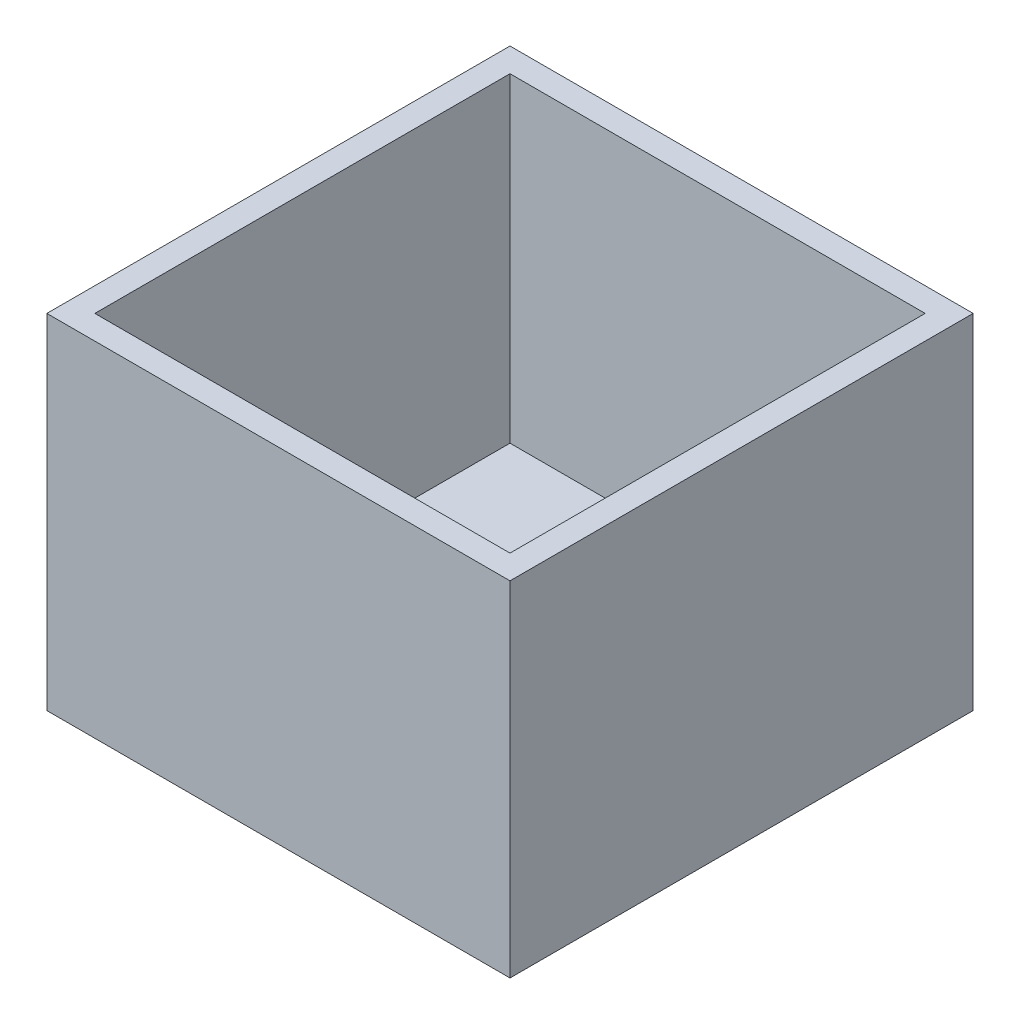
ISO-10303-21;
HEADER;
FILE_DESCRIPTION(('STEP AP214'),'2;1');
FILE_NAME('part.step','',(''),(''),'','','');
FILE_SCHEMA(('AUTOMOTIVE_DESIGN { 1 0 10303 214 1 1 1 1 }'));
ENDSEC;
DATA;
#1=APPLICATION_CONTEXT('core data for automotive mechanical design processes');
#2=APPLICATION_PROTOCOL_DEFINITION('international standard','automotive_design',2000,#1);
#3=PRODUCT_CONTEXT('',#1,'mechanical');
#4=PRODUCT('Part','Part','',(#3));
#5=PRODUCT_RELATED_PRODUCT_CATEGORY('part','',(#4));
#6=PRODUCT_DEFINITION_FORMATION('','',#4);
#7=PRODUCT_DEFINITION_CONTEXT('part definition',#1,'design');
#8=PRODUCT_DEFINITION('design','',#6,#7);
#9=PRODUCT_DEFINITION_SHAPE('','',#8);
#10=(LENGTH_UNIT() NAMED_UNIT(*) SI_UNIT(.MILLI.,.METRE.));
#11=(NAMED_UNIT(*) PLANE_ANGLE_UNIT() SI_UNIT($,.RADIAN.));
#12=(NAMED_UNIT(*) SI_UNIT($,.STERADIAN.) SOLID_ANGLE_UNIT());
#13=UNCERTAINTY_MEASURE_WITH_UNIT(LENGTH_MEASURE(1.E-05),#10,'distance_accuracy_value','');
#14=(GEOMETRIC_REPRESENTATION_CONTEXT(3) GLOBAL_UNCERTAINTY_ASSIGNED_CONTEXT((#13)) GLOBAL_UNIT_ASSIGNED_CONTEXT((#10,
#11,#12)) REPRESENTATION_CONTEXT('',''));
#15=CARTESIAN_POINT('',(0.,0.,0.));
#16=DIRECTION('',(0.,0.,1.));
#17=DIRECTION('',(1.,0.,0.));
#18=AXIS2_PLACEMENT_3D('',#15,#16,#17);
#19=CARTESIAN_POINT('',(-3.,3.,3.));
#20=DIRECTION('',(0.,0.,-1.));
#21=DIRECTION('',(-1.,0.,0.));
#22=AXIS2_PLACEMENT_3D('',#19,#20,#21);
#23=PLANE('',#22);
#24=DIRECTION('',(1.,0.,0.));
#25=VECTOR('',#24,1.);
#26=CARTESIAN_POINT('',(-3.,0.,3.));
#27=LINE('',#26,#25);
#28=CARTESIAN_POINT('',(-3.,0.,3.));
#29=VERTEX_POINT('',#28);
#30=CARTESIAN_POINT('',(54.9,0.,3.));
#31=VERTEX_POINT('',#30);
#32=EDGE_CURVE('E145',#29,#31,#27,.T.);
#33=ORIENTED_EDGE('',*,*,#32,.T.);
#34=DIRECTION('',(0.,-1.,0.));
#35=VECTOR('',#34,1.);
#36=CARTESIAN_POINT('',(54.9,3.,3.));
#37=LINE('',#36,#35);
#38=CARTESIAN_POINT('',(54.9,43.,3.));
#39=VERTEX_POINT('',#38);
#40=EDGE_CURVE('E11',#39,#31,#37,.T.);
#41=ORIENTED_EDGE('',*,*,#40,.F.);
#42=DIRECTION('',(1.,0.,0.));
#43=VECTOR('',#42,1.);
#44=CARTESIAN_POINT('',(-3.,43.,3.));
#45=LINE('',#44,#43);
#46=CARTESIAN_POINT('',(-3.,43.,3.));
#47=VERTEX_POINT('',#46);
#48=EDGE_CURVE('E136',#47,#39,#45,.T.);
#49=ORIENTED_EDGE('',*,*,#48,.F.);
#50=DIRECTION('',(0.,-1.,0.));
#51=VECTOR('',#50,1.);
#52=CARTESIAN_POINT('',(-3.,3.,3.));
#53=LINE('',#52,#51);
#54=EDGE_CURVE('E154',#47,#29,#53,.T.);
#55=ORIENTED_EDGE('',*,*,#54,.T.);
#56=EDGE_LOOP('',(#33,#41,#49,#55));
#57=FACE_BOUND('',#56,.T.);
#58=ADVANCED_FACE('F34',(#57),#23,.F.);
#59=CARTESIAN_POINT('',(54.9,3.,3.));
#60=DIRECTION('',(-1.,0.,0.));
#61=DIRECTION('',(0.,0.,1.));
#62=AXIS2_PLACEMENT_3D('',#59,#60,#61);
#63=PLANE('',#62);
#64=DIRECTION('',(0.,0.,-1.));
#65=VECTOR('',#64,1.);
#66=CARTESIAN_POINT('',(54.9,0.,3.));
#67=LINE('',#66,#65);
#68=CARTESIAN_POINT('',(54.9,0.,-54.9));
#69=VERTEX_POINT('',#68);
#70=EDGE_CURVE('E148',#31,#69,#67,.T.);
#71=ORIENTED_EDGE('',*,*,#70,.T.);
#72=DIRECTION('',(0.,-1.,0.));
#73=VECTOR('',#72,1.);
#74=CARTESIAN_POINT('',(54.9,3.,-54.9));
#75=LINE('',#74,#73);
#76=CARTESIAN_POINT('',(54.9,43.,-54.9));
#77=VERTEX_POINT('',#76);
#78=EDGE_CURVE('E41',#77,#69,#75,.T.);
#79=ORIENTED_EDGE('',*,*,#78,.F.);
#80=DIRECTION('',(0.,0.,-1.));
#81=VECTOR('',#80,1.);
#82=CARTESIAN_POINT('',(54.9,43.,3.));
#83=LINE('',#82,#81);
#84=EDGE_CURVE('E139',#39,#77,#83,.T.);
#85=ORIENTED_EDGE('',*,*,#84,.F.);
#86=ORIENTED_EDGE('',*,*,#40,.T.);
#87=EDGE_LOOP('',(#71,#79,#85,#86));
#88=FACE_BOUND('',#87,.T.);
#89=ADVANCED_FACE('F176',(#88),#63,.F.);
#90=CARTESIAN_POINT('',(-3.,3.,-54.9));
#91=DIRECTION('',(0.,0.,1.));
#92=DIRECTION('',(1.,0.,0.));
#93=AXIS2_PLACEMENT_3D('',#90,#91,#92);
#94=PLANE('',#93);
#95=DIRECTION('',(-1.,0.,0.));
#96=VECTOR('',#95,1.);
#97=CARTESIAN_POINT('',(-3.,0.,-54.9));
#98=LINE('',#97,#96);
#99=CARTESIAN_POINT('',(-3.,0.,-54.9));
#100=VERTEX_POINT('',#99);
#101=EDGE_CURVE('E150',#69,#100,#98,.T.);
#102=ORIENTED_EDGE('',*,*,#101,.T.);
#103=DIRECTION('',(0.,-1.,0.));
#104=VECTOR('',#103,1.);
#105=CARTESIAN_POINT('',(-3.,3.,-54.9));
#106=LINE('',#105,#104);
#107=CARTESIAN_POINT('',(-3.,43.,-54.9));
#108=VERTEX_POINT('',#107);
#109=EDGE_CURVE('E157',#108,#100,#106,.T.);
#110=ORIENTED_EDGE('',*,*,#109,.F.);
#111=DIRECTION('',(-1.,0.,0.));
#112=VECTOR('',#111,1.);
#113=CARTESIAN_POINT('',(54.9,43.,-54.9));
#114=LINE('',#113,#112);
#115=EDGE_CURVE('E142',#77,#108,#114,.T.);
#116=ORIENTED_EDGE('',*,*,#115,.F.);
#117=ORIENTED_EDGE('',*,*,#78,.T.);
#118=EDGE_LOOP('',(#102,#110,#116,#117));
#119=FACE_BOUND('',#118,.T.);
#120=ADVANCED_FACE('F163',(#119),#94,.F.);
#121=CARTESIAN_POINT('',(-3.,3.,3.));
#122=DIRECTION('',(1.,0.,0.));
#123=DIRECTION('',(0.,0.,-1.));
#124=AXIS2_PLACEMENT_3D('',#121,#122,#123);
#125=PLANE('',#124);
#126=DIRECTION('',(0.,0.,1.));
#127=VECTOR('',#126,1.);
#128=CARTESIAN_POINT('',(-3.,0.,3.));
#129=LINE('',#128,#127);
#130=EDGE_CURVE('E152',#100,#29,#129,.T.);
#131=ORIENTED_EDGE('',*,*,#130,.T.);
#132=ORIENTED_EDGE('',*,*,#54,.F.);
#133=DIRECTION('',(0.,0.,1.));
#134=VECTOR('',#133,1.);
#135=CARTESIAN_POINT('',(-3.,43.,-54.9));
#136=LINE('',#135,#134);
#137=EDGE_CURVE('E112',#108,#47,#136,.T.);
#138=ORIENTED_EDGE('',*,*,#137,.F.);
#139=ORIENTED_EDGE('',*,*,#109,.T.);
#140=EDGE_LOOP('',(#131,#132,#138,#139));
#141=FACE_BOUND('',#140,.T.);
#142=ADVANCED_FACE('F171',(#141),#125,.F.);
#143=CARTESIAN_POINT('',(0.,0.,0.));
#144=DIRECTION('',(0.,1.,0.));
#145=DIRECTION('',(0.,0.,1.));
#146=AXIS2_PLACEMENT_3D('',#143,#144,#145);
#147=PLANE('',#146);
#148=ORIENTED_EDGE('',*,*,#32,.F.);
#149=ORIENTED_EDGE('',*,*,#130,.F.);
#150=ORIENTED_EDGE('',*,*,#101,.F.);
#151=ORIENTED_EDGE('',*,*,#70,.F.);
#152=EDGE_LOOP('',(#148,#149,#150,#151));
#153=FACE_BOUND('',#152,.T.);
#154=ADVANCED_FACE('F169',(#153),#147,.F.);
#155=CARTESIAN_POINT('',(0.,43.,0.));
#156=DIRECTION('',(0.,1.,0.));
#157=DIRECTION('',(0.,0.,1.));
#158=AXIS2_PLACEMENT_3D('',#155,#156,#157);
#159=PLANE('',#158);
#160=ORIENTED_EDGE('',*,*,#137,.T.);
#161=ORIENTED_EDGE('',*,*,#48,.T.);
#162=ORIENTED_EDGE('',*,*,#84,.T.);
#163=ORIENTED_EDGE('',*,*,#115,.T.);
#164=EDGE_LOOP('',(#160,#161,#162,#163));
#165=FACE_BOUND('',#164,.T.);
#166=DIRECTION('',(0.,0.,-1.));
#167=VECTOR('',#166,1.);
#168=CARTESIAN_POINT('',(51.9,43.,0.));
#169=LINE('',#168,#167);
#170=CARTESIAN_POINT('',(51.9,43.,0.));
#171=VERTEX_POINT('',#170);
#172=CARTESIAN_POINT('',(51.9,43.,-51.9));
#173=VERTEX_POINT('',#172);
#174=EDGE_CURVE('E106',#171,#173,#169,.T.);
#175=ORIENTED_EDGE('',*,*,#174,.F.);
#176=DIRECTION('',(1.,0.,0.));
#177=VECTOR('',#176,1.);
#178=CARTESIAN_POINT('',(0.,43.,0.));
#179=LINE('',#178,#177);
#180=CARTESIAN_POINT('',(0.,43.,0.));
#181=VERTEX_POINT('',#180);
#182=EDGE_CURVE('E97',#181,#171,#179,.T.);
#183=ORIENTED_EDGE('',*,*,#182,.F.);
#184=DIRECTION('',(0.,0.,1.));
#185=VECTOR('',#184,1.);
#186=CARTESIAN_POINT('',(0.,43.,-51.9));
#187=LINE('',#186,#185);
#188=CARTESIAN_POINT('',(0.,43.,-51.9));
#189=VERTEX_POINT('',#188);
#190=EDGE_CURVE('E120',#189,#181,#187,.T.);
#191=ORIENTED_EDGE('',*,*,#190,.F.);
#192=DIRECTION('',(-1.,0.,0.));
#193=VECTOR('',#192,1.);
#194=CARTESIAN_POINT('',(51.9,43.,-51.9));
#195=LINE('',#194,#193);
#196=EDGE_CURVE('E118',#173,#189,#195,.T.);
#197=ORIENTED_EDGE('',*,*,#196,.F.);
#198=EDGE_LOOP('',(#175,#183,#191,#197));
#199=FACE_BOUND('',#198,.T.);
#200=ADVANCED_FACE('F116',(#165,#199),#159,.T.);
#201=CARTESIAN_POINT('',(0.,43.,0.));
#202=DIRECTION('',(0.,0.,-1.));
#203=DIRECTION('',(-1.,0.,0.));
#204=AXIS2_PLACEMENT_3D('',#201,#202,#203);
#205=PLANE('',#204);
#206=DIRECTION('',(1.,0.,0.));
#207=VECTOR('',#206,1.);
#208=CARTESIAN_POINT('',(0.,3.,0.));
#209=LINE('',#208,#207);
#210=CARTESIAN_POINT('',(0.,3.,0.));
#211=VERTEX_POINT('',#210);
#212=CARTESIAN_POINT('',(51.9,3.,0.));
#213=VERTEX_POINT('',#212);
#214=EDGE_CURVE('E48',#211,#213,#209,.T.);
#215=ORIENTED_EDGE('',*,*,#214,.F.);
#216=DIRECTION('',(0.,-1.,0.));
#217=VECTOR('',#216,1.);
#218=CARTESIAN_POINT('',(0.,43.,0.));
#219=LINE('',#218,#217);
#220=EDGE_CURVE('E102',#181,#211,#219,.T.);
#221=ORIENTED_EDGE('',*,*,#220,.F.);
#222=ORIENTED_EDGE('',*,*,#182,.T.);
#223=DIRECTION('',(0.,-1.,0.));
#224=VECTOR('',#223,1.);
#225=CARTESIAN_POINT('',(51.9,43.,0.));
#226=LINE('',#225,#224);
#227=EDGE_CURVE('E100',#171,#213,#226,.T.);
#228=ORIENTED_EDGE('',*,*,#227,.T.);
#229=EDGE_LOOP('',(#215,#221,#222,#228));
#230=FACE_BOUND('',#229,.T.);
#231=ADVANCED_FACE('F99',(#230),#205,.T.);
#232=CARTESIAN_POINT('',(51.9,43.,0.));
#233=DIRECTION('',(-1.,0.,0.));
#234=DIRECTION('',(0.,0.,1.));
#235=AXIS2_PLACEMENT_3D('',#232,#233,#234);
#236=PLANE('',#235);
#237=DIRECTION('',(0.,0.,-1.));
#238=VECTOR('',#237,1.);
#239=CARTESIAN_POINT('',(51.9,3.,0.));
#240=LINE('',#239,#238);
#241=CARTESIAN_POINT('',(51.9,3.,-51.9));
#242=VERTEX_POINT('',#241);
#243=EDGE_CURVE('E52',#213,#242,#240,.T.);
#244=ORIENTED_EDGE('',*,*,#243,.F.);
#245=ORIENTED_EDGE('',*,*,#227,.F.);
#246=ORIENTED_EDGE('',*,*,#174,.T.);
#247=DIRECTION('',(0.,-1.,0.));
#248=VECTOR('',#247,1.);
#249=CARTESIAN_POINT('',(51.9,43.,-51.9));
#250=LINE('',#249,#248);
#251=EDGE_CURVE('E113',#173,#242,#250,.T.);
#252=ORIENTED_EDGE('',*,*,#251,.T.);
#253=EDGE_LOOP('',(#244,#245,#246,#252));
#254=FACE_BOUND('',#253,.T.);
#255=ADVANCED_FACE('F110',(#254),#236,.T.);
#256=CARTESIAN_POINT('',(51.9,43.,-51.9));
#257=DIRECTION('',(0.,0.,1.));
#258=DIRECTION('',(1.,0.,0.));
#259=AXIS2_PLACEMENT_3D('',#256,#257,#258);
#260=PLANE('',#259);
#261=DIRECTION('',(-1.,0.,0.));
#262=VECTOR('',#261,1.);
#263=CARTESIAN_POINT('',(51.9,3.,-51.9));
#264=LINE('',#263,#262);
#265=CARTESIAN_POINT('',(0.,3.,-51.9));
#266=VERTEX_POINT('',#265);
#267=EDGE_CURVE('E126',#242,#266,#264,.T.);
#268=ORIENTED_EDGE('',*,*,#267,.F.);
#269=ORIENTED_EDGE('',*,*,#251,.F.);
#270=ORIENTED_EDGE('',*,*,#196,.T.);
#271=DIRECTION('',(0.,-1.,0.));
#272=VECTOR('',#271,1.);
#273=CARTESIAN_POINT('',(0.,43.,-51.9));
#274=LINE('',#273,#272);
#275=EDGE_CURVE('E130',#189,#266,#274,.T.);
#276=ORIENTED_EDGE('',*,*,#275,.T.);
#277=EDGE_LOOP('',(#268,#269,#270,#276));
#278=FACE_BOUND('',#277,.T.);
#279=ADVANCED_FACE('F198',(#278),#260,.T.);
#280=CARTESIAN_POINT('',(0.,43.,-51.9));
#281=DIRECTION('',(1.,0.,0.));
#282=DIRECTION('',(0.,0.,-1.));
#283=AXIS2_PLACEMENT_3D('',#280,#281,#282);
#284=PLANE('',#283);
#285=DIRECTION('',(0.,0.,1.));
#286=VECTOR('',#285,1.);
#287=CARTESIAN_POINT('',(0.,3.,-51.9));
#288=LINE('',#287,#286);
#289=EDGE_CURVE('E107',#266,#211,#288,.T.);
#290=ORIENTED_EDGE('',*,*,#289,.F.);
#291=ORIENTED_EDGE('',*,*,#275,.F.);
#292=ORIENTED_EDGE('',*,*,#190,.T.);
#293=ORIENTED_EDGE('',*,*,#220,.T.);
#294=EDGE_LOOP('',(#290,#291,#292,#293));
#295=FACE_BOUND('',#294,.T.);
#296=ADVANCED_FACE('F191',(#295),#284,.T.);
#297=CARTESIAN_POINT('',(0.,3.,0.));
#298=DIRECTION('',(0.,1.,0.));
#299=DIRECTION('',(0.,0.,1.));
#300=AXIS2_PLACEMENT_3D('',#297,#298,#299);
#301=PLANE('',#300);
#302=ORIENTED_EDGE('',*,*,#214,.T.);
#303=ORIENTED_EDGE('',*,*,#243,.T.);
#304=ORIENTED_EDGE('',*,*,#267,.T.);
#305=ORIENTED_EDGE('',*,*,#289,.T.);
#306=EDGE_LOOP('',(#302,#303,#304,#305));
#307=FACE_BOUND('',#306,.T.);
#308=ADVANCED_FACE('F188',(#307),#301,.T.);
#309=CLOSED_SHELL('',(#58,#89,#120,#142,#154,#200,#231,#255,#279,#296,#308));
#310=MANIFOLD_SOLID_BREP('B2',#309);
#311=ADVANCED_BREP_SHAPE_REPRESENTATION('',(#18,#310),#14);
#312=SHAPE_DEFINITION_REPRESENTATION(#9,#311);
ENDSEC;
END-ISO-10303-21;
